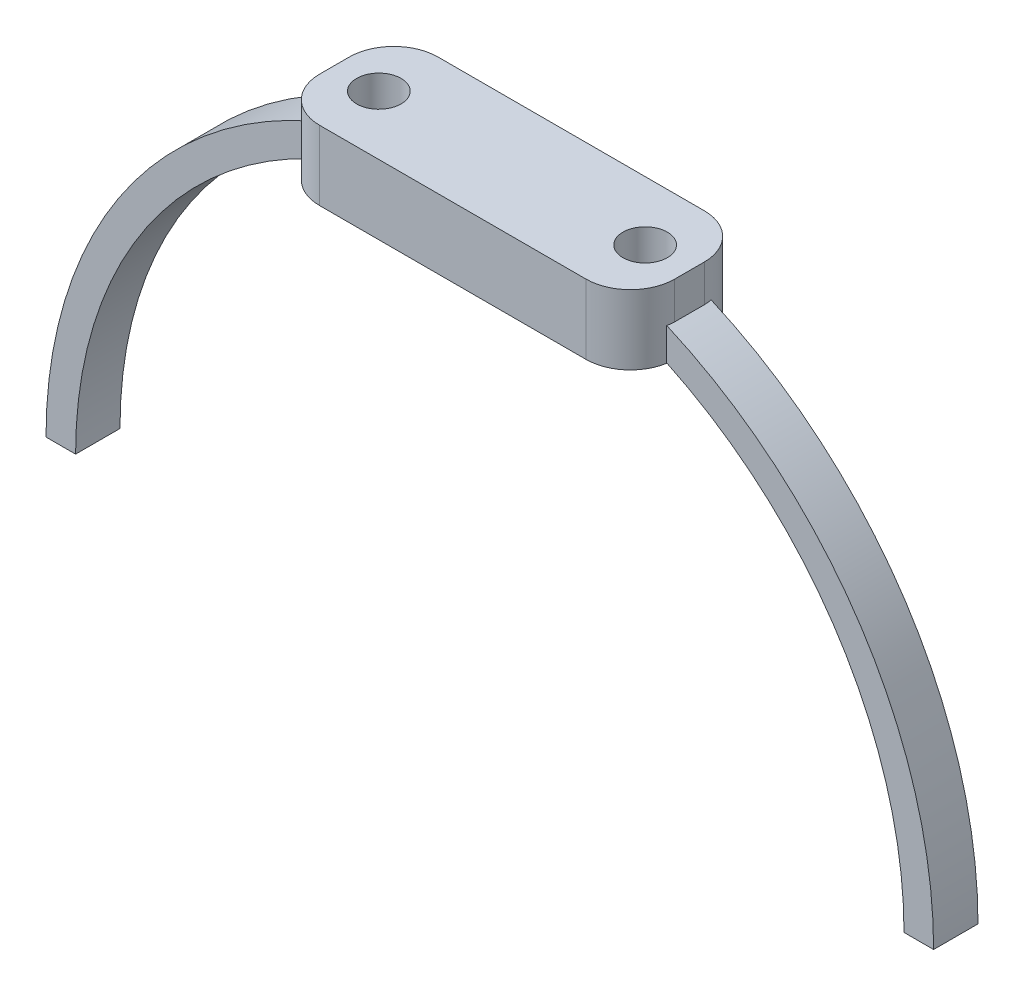
ISO-10303-21;
HEADER;
FILE_DESCRIPTION(('STEP AP214'),'2;1');
FILE_NAME('part.step','',(''),(''),'','','');
FILE_SCHEMA(('AUTOMOTIVE_DESIGN { 1 0 10303 214 1 1 1 1 }'));
ENDSEC;
DATA;
#1=APPLICATION_CONTEXT('core data for automotive mechanical design processes');
#2=APPLICATION_PROTOCOL_DEFINITION('international standard','automotive_design',2000,#1);
#3=PRODUCT_CONTEXT('',#1,'mechanical');
#4=PRODUCT('Part','Part','',(#3));
#5=PRODUCT_RELATED_PRODUCT_CATEGORY('part','',(#4));
#6=PRODUCT_DEFINITION_FORMATION('','',#4);
#7=PRODUCT_DEFINITION_CONTEXT('part definition',#1,'design');
#8=PRODUCT_DEFINITION('design','',#6,#7);
#9=PRODUCT_DEFINITION_SHAPE('','',#8);
#10=(LENGTH_UNIT() NAMED_UNIT(*) SI_UNIT(.MILLI.,.METRE.));
#11=(NAMED_UNIT(*) PLANE_ANGLE_UNIT() SI_UNIT($,.RADIAN.));
#12=(NAMED_UNIT(*) SI_UNIT($,.STERADIAN.) SOLID_ANGLE_UNIT());
#13=UNCERTAINTY_MEASURE_WITH_UNIT(LENGTH_MEASURE(1.E-05),#10,'distance_accuracy_value','');
#14=(GEOMETRIC_REPRESENTATION_CONTEXT(3) GLOBAL_UNCERTAINTY_ASSIGNED_CONTEXT((#13)) GLOBAL_UNIT_ASSIGNED_CONTEXT((#10,
#11,#12)) REPRESENTATION_CONTEXT('',''));
#15=CARTESIAN_POINT('',(0.,0.,0.));
#16=DIRECTION('',(0.,0.,1.));
#17=DIRECTION('',(1.,0.,0.));
#18=AXIS2_PLACEMENT_3D('',#15,#16,#17);
#19=CARTESIAN_POINT('',(-12.,-1.,-4.));
#20=DIRECTION('',(-1.,0.,0.));
#21=DIRECTION('',(0.,0.,1.));
#22=AXIS2_PLACEMENT_3D('',#19,#20,#21);
#23=PLANE('',#22);
#24=DIRECTION('',(0.,0.,1.));
#25=VECTOR('',#24,1.);
#26=CARTESIAN_POINT('',(-12.,-2.50454583026497,-1.5));
#27=LINE('',#26,#25);
#28=CARTESIAN_POINT('',(-12.,-2.50454583026497,-1.));
#29=VERTEX_POINT('',#28);
#30=CARTESIAN_POINT('',(-12.,-2.50454583026497,1.));
#31=VERTEX_POINT('',#30);
#32=EDGE_CURVE('E223',#29,#31,#27,.T.);
#33=ORIENTED_EDGE('',*,*,#32,.T.);
#34=DIRECTION('',(0.,1.,0.));
#35=VECTOR('',#34,1.);
#36=CARTESIAN_POINT('',(-12.,-1.,1.));
#37=LINE('',#36,#35);
#38=CARTESIAN_POINT('',(-12.,0.,1.));
#39=VERTEX_POINT('',#38);
#40=EDGE_CURVE('E257',#31,#39,#37,.T.);
#41=ORIENTED_EDGE('',*,*,#40,.T.);
#42=DIRECTION('',(0.,0.,1.));
#43=VECTOR('',#42,1.);
#44=CARTESIAN_POINT('',(-12.,0.,-4.));
#45=LINE('',#44,#43);
#46=CARTESIAN_POINT('',(-12.,0.,-1.));
#47=VERTEX_POINT('',#46);
#48=EDGE_CURVE('E237',#47,#39,#45,.T.);
#49=ORIENTED_EDGE('',*,*,#48,.F.);
#50=DIRECTION('',(0.,1.,0.));
#51=VECTOR('',#50,1.);
#52=CARTESIAN_POINT('',(-12.,-1.,-1.));
#53=LINE('',#52,#51);
#54=EDGE_CURVE('E249',#47,#29,#53,.F.);
#55=ORIENTED_EDGE('',*,*,#54,.T.);
#56=EDGE_LOOP('',(#33,#41,#49,#55));
#57=FACE_BOUND('',#56,.T.);
#58=ADVANCED_FACE('F35',(#57),#23,.T.);
#59=CARTESIAN_POINT('',(12.,-1.,-4.));
#60=DIRECTION('',(1.,0.,0.));
#61=DIRECTION('',(0.,0.,-1.));
#62=AXIS2_PLACEMENT_3D('',#59,#60,#61);
#63=PLANE('',#62);
#64=DIRECTION('',(0.,0.,-1.));
#65=VECTOR('',#64,1.);
#66=CARTESIAN_POINT('',(12.,0.,-4.));
#67=LINE('',#66,#65);
#68=CARTESIAN_POINT('',(12.,0.,1.));
#69=VERTEX_POINT('',#68);
#70=CARTESIAN_POINT('',(12.,0.,-1.));
#71=VERTEX_POINT('',#70);
#72=EDGE_CURVE('E243',#69,#71,#67,.T.);
#73=ORIENTED_EDGE('',*,*,#72,.F.);
#74=DIRECTION('',(0.,1.,0.));
#75=VECTOR('',#74,1.);
#76=CARTESIAN_POINT('',(12.,-1.,1.));
#77=LINE('',#76,#75);
#78=CARTESIAN_POINT('',(12.,-2.50454583026497,1.));
#79=VERTEX_POINT('',#78);
#80=EDGE_CURVE('E299',#69,#79,#77,.F.);
#81=ORIENTED_EDGE('',*,*,#80,.T.);
#82=DIRECTION('',(0.,0.,1.));
#83=VECTOR('',#82,1.);
#84=CARTESIAN_POINT('',(12.,-2.50454583026497,-1.5));
#85=LINE('',#84,#83);
#86=CARTESIAN_POINT('',(12.,-2.50454583026497,-1.));
#87=VERTEX_POINT('',#86);
#88=EDGE_CURVE('E217',#79,#87,#85,.F.);
#89=ORIENTED_EDGE('',*,*,#88,.T.);
#90=DIRECTION('',(0.,1.,0.));
#91=VECTOR('',#90,1.);
#92=CARTESIAN_POINT('',(12.,-1.,-1.));
#93=LINE('',#92,#91);
#94=EDGE_CURVE('E296',#87,#71,#93,.T.);
#95=ORIENTED_EDGE('',*,*,#94,.T.);
#96=EDGE_LOOP('',(#73,#81,#89,#95));
#97=FACE_BOUND('',#96,.T.);
#98=ADVANCED_FACE('F357',(#97),#63,.T.);
#99=CARTESIAN_POINT('',(12.,-1.,-4.));
#100=DIRECTION('',(0.,0.,-1.));
#101=DIRECTION('',(-1.,0.,0.));
#102=AXIS2_PLACEMENT_3D('',#99,#100,#101);
#103=PLANE('',#102);
#104=DIRECTION('',(1.,0.,0.));
#105=VECTOR('',#104,1.);
#106=CARTESIAN_POINT('',(-12.,-4.70177871865297,-4.));
#107=LINE('',#106,#105);
#108=CARTESIAN_POINT('',(-9.,-4.70177871865297,-4.));
#109=VERTEX_POINT('',#108);
#110=CARTESIAN_POINT('',(9.00000000000001,-4.70177871865297,-4.));
#111=VERTEX_POINT('',#110);
#112=EDGE_CURVE('E229',#109,#111,#107,.T.);
#113=ORIENTED_EDGE('',*,*,#112,.F.);
#114=DIRECTION('',(0.,1.,0.));
#115=VECTOR('',#114,1.);
#116=CARTESIAN_POINT('',(-9.,-1.,-4.));
#117=LINE('',#116,#115);
#118=CARTESIAN_POINT('',(-8.99999999999999,0.,-4.));
#119=VERTEX_POINT('',#118);
#120=EDGE_CURVE('E293',#109,#119,#117,.T.);
#121=ORIENTED_EDGE('',*,*,#120,.T.);
#122=DIRECTION('',(-1.,0.,0.));
#123=VECTOR('',#122,1.);
#124=CARTESIAN_POINT('',(12.,0.,-4.));
#125=LINE('',#124,#123);
#126=CARTESIAN_POINT('',(9.00000000000001,0.,-4.));
#127=VERTEX_POINT('',#126);
#128=EDGE_CURVE('E246',#127,#119,#125,.T.);
#129=ORIENTED_EDGE('',*,*,#128,.F.);
#130=DIRECTION('',(0.,1.,0.));
#131=VECTOR('',#130,1.);
#132=CARTESIAN_POINT('',(9.00000000000001,-1.,-4.));
#133=LINE('',#132,#131);
#134=EDGE_CURVE('E291',#127,#111,#133,.F.);
#135=ORIENTED_EDGE('',*,*,#134,.T.);
#136=EDGE_LOOP('',(#113,#121,#129,#135));
#137=FACE_BOUND('',#136,.T.);
#138=ADVANCED_FACE('F377',(#137),#103,.T.);
#139=CARTESIAN_POINT('',(12.,-1.,4.));
#140=DIRECTION('',(0.,0.,1.));
#141=DIRECTION('',(1.,0.,0.));
#142=AXIS2_PLACEMENT_3D('',#139,#140,#141);
#143=PLANE('',#142);
#144=DIRECTION('',(1.,0.,0.));
#145=VECTOR('',#144,1.);
#146=CARTESIAN_POINT('',(12.,0.,4.));
#147=LINE('',#146,#145);
#148=CARTESIAN_POINT('',(-9.,0.,4.));
#149=VERTEX_POINT('',#148);
#150=CARTESIAN_POINT('',(9.,0.,4.));
#151=VERTEX_POINT('',#150);
#152=EDGE_CURVE('E240',#149,#151,#147,.T.);
#153=ORIENTED_EDGE('',*,*,#152,.F.);
#154=DIRECTION('',(0.,1.,0.));
#155=VECTOR('',#154,1.);
#156=CARTESIAN_POINT('',(-9.,-1.,4.));
#157=LINE('',#156,#155);
#158=CARTESIAN_POINT('',(-9.,-4.70177871865297,4.));
#159=VERTEX_POINT('',#158);
#160=EDGE_CURVE('E271',#149,#159,#157,.F.);
#161=ORIENTED_EDGE('',*,*,#160,.T.);
#162=DIRECTION('',(1.,0.,0.));
#163=VECTOR('',#162,1.);
#164=CARTESIAN_POINT('',(-12.,-4.70177871865297,4.));
#165=LINE('',#164,#163);
#166=CARTESIAN_POINT('',(9.00000000000001,-4.70177871865297,4.));
#167=VERTEX_POINT('',#166);
#168=EDGE_CURVE('E226',#159,#167,#165,.T.);
#169=ORIENTED_EDGE('',*,*,#168,.T.);
#170=DIRECTION('',(0.,1.,0.));
#171=VECTOR('',#170,1.);
#172=CARTESIAN_POINT('',(9.,-1.,4.));
#173=LINE('',#172,#171);
#174=EDGE_CURVE('E268',#167,#151,#173,.T.);
#175=ORIENTED_EDGE('',*,*,#174,.T.);
#176=EDGE_LOOP('',(#153,#161,#169,#175));
#177=FACE_BOUND('',#176,.T.);
#178=ADVANCED_FACE('F385',(#177),#143,.T.);
#179=CARTESIAN_POINT('',(0.,0.,0.));
#180=DIRECTION('',(0.,-1.,0.));
#181=DIRECTION('',(0.,0.,-1.));
#182=AXIS2_PLACEMENT_3D('',#179,#180,#181);
#183=PLANE('',#182);
#184=CARTESIAN_POINT('',(-9.,0.,0.));
#185=DIRECTION('',(0.,1.,0.));
#186=DIRECTION('',(0.,0.,1.));
#187=AXIS2_PLACEMENT_3D('',#184,#185,#186);
#188=CIRCLE('',#187,1.5);
#189=CARTESIAN_POINT('',(-9.,0.,1.5));
#190=VERTEX_POINT('',#189);
#191=EDGE_CURVE('E253',#190,#190,#188,.T.);
#192=ORIENTED_EDGE('',*,*,#191,.F.);
#193=EDGE_LOOP('',(#192));
#194=FACE_BOUND('',#193,.T.);
#195=CARTESIAN_POINT('',(9.,0.,0.));
#196=DIRECTION('',(0.,1.,0.));
#197=DIRECTION('',(0.,0.,1.));
#198=AXIS2_PLACEMENT_3D('',#195,#196,#197);
#199=CIRCLE('',#198,1.5);
#200=CARTESIAN_POINT('',(9.,0.,1.5));
#201=VERTEX_POINT('',#200);
#202=EDGE_CURVE('E197',#201,#201,#199,.T.);
#203=ORIENTED_EDGE('',*,*,#202,.F.);
#204=EDGE_LOOP('',(#203));
#205=FACE_BOUND('',#204,.T.);
#206=ORIENTED_EDGE('',*,*,#48,.T.);
#207=CARTESIAN_POINT('',(-9.,0.,1.));
#208=DIRECTION('',(0.,-1.,0.));
#209=DIRECTION('',(0.,0.,-1.));
#210=AXIS2_PLACEMENT_3D('',#207,#208,#209);
#211=CIRCLE('',#210,3.);
#212=EDGE_CURVE('E266',#39,#149,#211,.F.);
#213=ORIENTED_EDGE('',*,*,#212,.T.);
#214=ORIENTED_EDGE('',*,*,#152,.T.);
#215=CARTESIAN_POINT('',(9.,0.,0.999999999999999));
#216=DIRECTION('',(0.,-1.,0.));
#217=DIRECTION('',(0.,0.,-1.));
#218=AXIS2_PLACEMENT_3D('',#215,#216,#217);
#219=CIRCLE('',#218,3.);
#220=EDGE_CURVE('E262',#151,#69,#219,.F.);
#221=ORIENTED_EDGE('',*,*,#220,.T.);
#222=ORIENTED_EDGE('',*,*,#72,.T.);
#223=CARTESIAN_POINT('',(9.00000000000001,0.,-1.));
#224=DIRECTION('',(0.,-1.,0.));
#225=DIRECTION('',(0.,0.,-1.));
#226=AXIS2_PLACEMENT_3D('',#223,#224,#225);
#227=CIRCLE('',#226,3.);
#228=EDGE_CURVE('E260',#71,#127,#227,.F.);
#229=ORIENTED_EDGE('',*,*,#228,.T.);
#230=ORIENTED_EDGE('',*,*,#128,.T.);
#231=CARTESIAN_POINT('',(-9.,0.,-1.));
#232=DIRECTION('',(0.,-1.,0.));
#233=DIRECTION('',(0.,0.,-1.));
#234=AXIS2_PLACEMENT_3D('',#231,#232,#233);
#235=CIRCLE('',#234,3.);
#236=EDGE_CURVE('E264',#119,#47,#235,.F.);
#237=ORIENTED_EDGE('',*,*,#236,.T.);
#238=EDGE_LOOP('',(#206,#213,#214,#221,#222,#229,#230,#237));
#239=FACE_BOUND('',#238,.T.);
#240=ADVANCED_FACE('F380',(#194,#205,#239),#183,.F.);
#241=CARTESIAN_POINT('',(-12.,-4.70177871865297,-28.4562205403692));
#242=DIRECTION('',(0.,-1.,0.));
#243=DIRECTION('',(0.,0.,-1.));
#244=AXIS2_PLACEMENT_3D('',#241,#242,#243);
#245=PLANE('',#244);
#246=CARTESIAN_POINT('',(-9.,-4.70177871865297,0.));
#247=DIRECTION('',(0.,-1.,0.));
#248=DIRECTION('',(0.,0.,-1.));
#249=AXIS2_PLACEMENT_3D('',#246,#247,#248);
#250=CIRCLE('',#249,1.5);
#251=CARTESIAN_POINT('',(-9.,-4.70177871865297,1.5));
#252=VERTEX_POINT('',#251);
#253=EDGE_CURVE('E195',#252,#252,#250,.T.);
#254=ORIENTED_EDGE('',*,*,#253,.F.);
#255=EDGE_LOOP('',(#254));
#256=FACE_BOUND('',#255,.T.);
#257=CARTESIAN_POINT('',(9.,-4.70177871865297,0.));
#258=DIRECTION('',(0.,-1.,0.));
#259=DIRECTION('',(0.,0.,-1.));
#260=AXIS2_PLACEMENT_3D('',#257,#258,#259);
#261=CIRCLE('',#260,1.5);
#262=CARTESIAN_POINT('',(9.,-4.70177871865297,1.5));
#263=VERTEX_POINT('',#262);
#264=EDGE_CURVE('E250',#263,#263,#261,.T.);
#265=ORIENTED_EDGE('',*,*,#264,.F.);
#266=EDGE_LOOP('',(#265));
#267=FACE_BOUND('',#266,.T.);
#268=CARTESIAN_POINT('',(-9.,-4.70177871865297,1.));
#269=DIRECTION('',(0.,-1.,0.));
#270=DIRECTION('',(0.,0.,-1.));
#271=AXIS2_PLACEMENT_3D('',#268,#269,#270);
#272=CIRCLE('',#271,3.);
#273=CARTESIAN_POINT('',(-11.9580398915498,-4.70177871865297,1.5));
#274=VERTEX_POINT('',#273);
#275=EDGE_CURVE('E286',#159,#274,#272,.T.);
#276=ORIENTED_EDGE('',*,*,#275,.T.);
#277=DIRECTION('',(-1.,0.,0.));
#278=VECTOR('',#277,1.);
#279=CARTESIAN_POINT('',(-12.,-4.70177871865297,1.5));
#280=LINE('',#279,#278);
#281=CARTESIAN_POINT('',(-12.,-4.70177871865297,1.5));
#282=VERTEX_POINT('',#281);
#283=EDGE_CURVE('E289',#274,#282,#280,.T.);
#284=ORIENTED_EDGE('',*,*,#283,.T.);
#285=DIRECTION('',(0.,0.,1.));
#286=VECTOR('',#285,1.);
#287=CARTESIAN_POINT('',(-12.,-4.70177871865297,-28.4562205403692));
#288=LINE('',#287,#286);
#289=CARTESIAN_POINT('',(-12.,-4.70177871865297,-1.5));
#290=VERTEX_POINT('',#289);
#291=EDGE_CURVE('E234',#290,#282,#288,.T.);
#292=ORIENTED_EDGE('',*,*,#291,.F.);
#293=DIRECTION('',(1.,0.,0.));
#294=VECTOR('',#293,1.);
#295=CARTESIAN_POINT('',(0.,-4.70177871865297,-1.5));
#296=LINE('',#295,#294);
#297=CARTESIAN_POINT('',(-11.9580398915498,-4.70177871865297,-1.5));
#298=VERTEX_POINT('',#297);
#299=EDGE_CURVE('E283',#290,#298,#296,.T.);
#300=ORIENTED_EDGE('',*,*,#299,.T.);
#301=CARTESIAN_POINT('',(-9.,-4.70177871865297,-1.));
#302=DIRECTION('',(0.,-1.,0.));
#303=DIRECTION('',(0.,0.,-1.));
#304=AXIS2_PLACEMENT_3D('',#301,#302,#303);
#305=CIRCLE('',#304,3.);
#306=EDGE_CURVE('E281',#298,#109,#305,.T.);
#307=ORIENTED_EDGE('',*,*,#306,.T.);
#308=ORIENTED_EDGE('',*,*,#112,.T.);
#309=CARTESIAN_POINT('',(9.00000000000001,-4.70177871865297,-1.));
#310=DIRECTION('',(0.,-1.,0.));
#311=DIRECTION('',(0.,0.,-1.));
#312=AXIS2_PLACEMENT_3D('',#309,#310,#311);
#313=CIRCLE('',#312,3.);
#314=CARTESIAN_POINT('',(11.9580398915498,-4.70177871865297,-1.5));
#315=VERTEX_POINT('',#314);
#316=EDGE_CURVE('E273',#111,#315,#313,.T.);
#317=ORIENTED_EDGE('',*,*,#316,.T.);
#318=DIRECTION('',(1.,0.,0.));
#319=VECTOR('',#318,1.);
#320=CARTESIAN_POINT('',(0.,-4.70177871865297,-1.5));
#321=LINE('',#320,#319);
#322=CARTESIAN_POINT('',(12.,-4.70177871865297,-1.5));
#323=VERTEX_POINT('',#322);
#324=EDGE_CURVE('E276',#315,#323,#321,.T.);
#325=ORIENTED_EDGE('',*,*,#324,.T.);
#326=DIRECTION('',(0.,0.,1.));
#327=VECTOR('',#326,1.);
#328=CARTESIAN_POINT('',(12.,-4.70177871865297,-28.4562205403692));
#329=LINE('',#328,#327);
#330=CARTESIAN_POINT('',(12.,-4.70177871865297,1.5));
#331=VERTEX_POINT('',#330);
#332=EDGE_CURVE('E232',#323,#331,#329,.T.);
#333=ORIENTED_EDGE('',*,*,#332,.T.);
#334=DIRECTION('',(-1.,0.,0.));
#335=VECTOR('',#334,1.);
#336=CARTESIAN_POINT('',(-12.,-4.70177871865297,1.5));
#337=LINE('',#336,#335);
#338=CARTESIAN_POINT('',(11.9580398915498,-4.70177871865297,1.5));
#339=VERTEX_POINT('',#338);
#340=EDGE_CURVE('E63',#331,#339,#337,.T.);
#341=ORIENTED_EDGE('',*,*,#340,.T.);
#342=CARTESIAN_POINT('',(9.,-4.70177871865297,0.999999999999999));
#343=DIRECTION('',(0.,-1.,0.));
#344=DIRECTION('',(0.,0.,-1.));
#345=AXIS2_PLACEMENT_3D('',#342,#343,#344);
#346=CIRCLE('',#345,3.);
#347=EDGE_CURVE('E278',#339,#167,#346,.T.);
#348=ORIENTED_EDGE('',*,*,#347,.T.);
#349=ORIENTED_EDGE('',*,*,#168,.F.);
#350=EDGE_LOOP('',(#276,#284,#292,#300,#307,#308,#317,#325,#333,#341,#348,#349));
#351=FACE_BOUND('',#350,.T.);
#352=ADVANCED_FACE('F372',(#256,#267,#351),#245,.T.);
#353=CARTESIAN_POINT('',(0.,-30.,-1.5));
#354=DIRECTION('',(0.,-1.,0.));
#355=DIRECTION('',(1.,0.,0.));
#356=AXIS2_PLACEMENT_3D('',#353,#354,#355);
#357=PLANE('',#356);
#358=DIRECTION('',(0.,0.,1.));
#359=VECTOR('',#358,1.);
#360=CARTESIAN_POINT('',(-28.,-30.,-1.5));
#361=LINE('',#360,#359);
#362=CARTESIAN_POINT('',(-28.,-30.,-1.5));
#363=VERTEX_POINT('',#362);
#364=CARTESIAN_POINT('',(-28.,-30.,1.5));
#365=VERTEX_POINT('',#364);
#366=EDGE_CURVE('E177',#363,#365,#361,.T.);
#367=ORIENTED_EDGE('',*,*,#366,.T.);
#368=DIRECTION('',(1.,0.,0.));
#369=VECTOR('',#368,1.);
#370=CARTESIAN_POINT('',(0.,-30.,1.5));
#371=LINE('',#370,#369);
#372=CARTESIAN_POINT('',(-30.,-30.,1.5));
#373=VERTEX_POINT('',#372);
#374=EDGE_CURVE('E182',#373,#365,#371,.T.);
#375=ORIENTED_EDGE('',*,*,#374,.F.);
#376=DIRECTION('',(0.,0.,1.));
#377=VECTOR('',#376,1.);
#378=CARTESIAN_POINT('',(-30.,-30.,-1.5));
#379=LINE('',#378,#377);
#380=CARTESIAN_POINT('',(-30.,-30.,-1.5));
#381=VERTEX_POINT('',#380);
#382=EDGE_CURVE('E165',#381,#373,#379,.T.);
#383=ORIENTED_EDGE('',*,*,#382,.F.);
#384=DIRECTION('',(1.,0.,0.));
#385=VECTOR('',#384,1.);
#386=CARTESIAN_POINT('',(0.,-30.,-1.5));
#387=LINE('',#386,#385);
#388=EDGE_CURVE('E207',#381,#363,#387,.T.);
#389=ORIENTED_EDGE('',*,*,#388,.T.);
#390=EDGE_LOOP('',(#367,#375,#383,#389));
#391=FACE_BOUND('',#390,.T.);
#392=ADVANCED_FACE('F183',(#391),#357,.T.);
#393=CARTESIAN_POINT('',(0.,-30.,-1.5));
#394=DIRECTION('',(0.,0.,1.));
#395=DIRECTION('',(1.,0.,0.));
#396=AXIS2_PLACEMENT_3D('',#393,#394,#395);
#397=CYLINDRICAL_SURFACE('',#396,28.);
#398=ORIENTED_EDGE('',*,*,#291,.T.);
#399=CARTESIAN_POINT('',(0.,-30.,1.5));
#400=DIRECTION('',(0.,0.,1.));
#401=DIRECTION('',(1.,0.,0.));
#402=AXIS2_PLACEMENT_3D('',#399,#400,#401);
#403=CIRCLE('',#402,28.);
#404=EDGE_CURVE('E187',#282,#365,#403,.T.);
#405=ORIENTED_EDGE('',*,*,#404,.T.);
#406=ORIENTED_EDGE('',*,*,#366,.F.);
#407=CARTESIAN_POINT('',(0.,-30.,-1.5));
#408=DIRECTION('',(0.,0.,1.));
#409=DIRECTION('',(1.,0.,0.));
#410=AXIS2_PLACEMENT_3D('',#407,#408,#409);
#411=CIRCLE('',#410,28.);
#412=EDGE_CURVE('E209',#290,#363,#411,.T.);
#413=ORIENTED_EDGE('',*,*,#412,.F.);
#414=EDGE_LOOP('',(#398,#405,#406,#413));
#415=FACE_BOUND('',#414,.T.);
#416=ADVANCED_FACE('F392',(#415),#397,.F.);
#417=CARTESIAN_POINT('',(0.,0.,1.5));
#418=DIRECTION('',(0.,0.,1.));
#419=DIRECTION('',(1.,0.,0.));
#420=AXIS2_PLACEMENT_3D('',#417,#418,#419);
#421=PLANE('',#420);
#422=ORIENTED_EDGE('',*,*,#404,.F.);
#423=ORIENTED_EDGE('',*,*,#283,.F.);
#424=DIRECTION('',(0.,1.,0.));
#425=VECTOR('',#424,1.);
#426=CARTESIAN_POINT('',(-11.9580398915498,-4.70177871865297,1.5));
#427=LINE('',#426,#425);
#428=CARTESIAN_POINT('',(-11.9580398915498,-2.48627102786497,1.5));
#429=VERTEX_POINT('',#428);
#430=EDGE_CURVE('E191',#274,#429,#427,.T.);
#431=ORIENTED_EDGE('',*,*,#430,.T.);
#432=CARTESIAN_POINT('',(0.,-30.,1.5));
#433=DIRECTION('',(0.,0.,1.));
#434=DIRECTION('',(1.,0.,0.));
#435=AXIS2_PLACEMENT_3D('',#432,#433,#434);
#436=CIRCLE('',#435,30.);
#437=EDGE_CURVE('E170',#373,#429,#436,.F.);
#438=ORIENTED_EDGE('',*,*,#437,.F.);
#439=ORIENTED_EDGE('',*,*,#374,.T.);
#440=EDGE_LOOP('',(#422,#423,#431,#438,#439));
#441=FACE_BOUND('',#440,.T.);
#442=ADVANCED_FACE('F189',(#441),#421,.T.);
#443=CARTESIAN_POINT('',(0.,0.,-1.5));
#444=DIRECTION('',(0.,0.,1.));
#445=DIRECTION('',(1.,0.,0.));
#446=AXIS2_PLACEMENT_3D('',#443,#444,#445);
#447=PLANE('',#446);
#448=CARTESIAN_POINT('',(0.,-30.,-1.5));
#449=DIRECTION('',(0.,0.,1.));
#450=DIRECTION('',(1.,0.,0.));
#451=AXIS2_PLACEMENT_3D('',#448,#449,#450);
#452=CIRCLE('',#451,30.);
#453=CARTESIAN_POINT('',(-11.9580398915498,-2.48627102786497,-1.5));
#454=VERTEX_POINT('',#453);
#455=EDGE_CURVE('E173',#381,#454,#452,.F.);
#456=ORIENTED_EDGE('',*,*,#455,.T.);
#457=DIRECTION('',(0.,1.,0.));
#458=VECTOR('',#457,1.);
#459=CARTESIAN_POINT('',(-11.9580398915498,-2.48627102786497,-1.5));
#460=LINE('',#459,#458);
#461=EDGE_CURVE('E344',#454,#298,#460,.F.);
#462=ORIENTED_EDGE('',*,*,#461,.T.);
#463=ORIENTED_EDGE('',*,*,#299,.F.);
#464=ORIENTED_EDGE('',*,*,#412,.T.);
#465=ORIENTED_EDGE('',*,*,#388,.F.);
#466=EDGE_LOOP('',(#456,#462,#463,#464,#465));
#467=FACE_BOUND('',#466,.T.);
#468=ADVANCED_FACE('F394',(#467),#447,.F.);
#469=CARTESIAN_POINT('',(0.,-30.,-1.5));
#470=DIRECTION('',(0.,0.,1.));
#471=DIRECTION('',(1.,0.,0.));
#472=AXIS2_PLACEMENT_3D('',#469,#470,#471);
#473=CYLINDRICAL_SURFACE('',#472,30.);
#474=ORIENTED_EDGE('',*,*,#32,.F.);
#475=CARTESIAN_POINT('',(-12.,-2.50454583026497,-1.));
#476=CARTESIAN_POINT('',(-11.9999784934391,-2.5045316933195,-1.08402921821506));
#477=CARTESIAN_POINT('',(-11.9964710644505,-2.50300172464501,-1.16771049401314));
#478=CARTESIAN_POINT('',(-11.9824843616257,-2.49691012384151,-1.334377160679));
#479=CARTESIAN_POINT('',(-11.9720050877976,-2.492348491716,-1.41736255154759));
#480=CARTESIAN_POINT('',(-11.9580398915498,-2.48627102786496,-1.5));
#481=B_SPLINE_CURVE_WITH_KNOTS('',3,(#475,#476,#477,#478,#479,#480),.UNSPECIFIED.,.F.,.F.,(4,2,
4),(0.,0.251306165927237,0.502612331563934),.UNSPECIFIED.);
#482=EDGE_CURVE('E309',#29,#454,#481,.T.);
#483=ORIENTED_EDGE('',*,*,#482,.T.);
#484=ORIENTED_EDGE('',*,*,#455,.F.);
#485=ORIENTED_EDGE('',*,*,#382,.T.);
#486=ORIENTED_EDGE('',*,*,#437,.T.);
#487=CARTESIAN_POINT('',(-11.9580398915498,-2.48627102786497,1.5));
#488=CARTESIAN_POINT('',(-11.9720050877976,-2.49234849171599,1.41736255154759));
#489=CARTESIAN_POINT('',(-11.9824843616257,-2.4969101238415,1.334377160679));
#490=CARTESIAN_POINT('',(-11.9964710644505,-2.50300172464501,1.16771049401314));
#491=CARTESIAN_POINT('',(-11.9999784934391,-2.5045316933195,1.08402921821506));
#492=CARTESIAN_POINT('',(-12.,-2.50454583026497,1.));
#493=B_SPLINE_CURVE_WITH_KNOTS('',3,(#487,#488,#489,#490,#491,#492),.UNSPECIFIED.,.F.,.F.,(4,2,
4),(0.,0.251306165636698,0.502612331563934),.UNSPECIFIED.);
#494=EDGE_CURVE('E302',#429,#31,#493,.T.);
#495=ORIENTED_EDGE('',*,*,#494,.T.);
#496=EDGE_LOOP('',(#474,#483,#484,#485,#486,#495));
#497=FACE_BOUND('',#496,.T.);
#498=ADVANCED_FACE('F168',(#497),#473,.T.);
#499=ORIENTED_EDGE('',*,*,#332,.F.);
#500=CARTESIAN_POINT('',(28.,-30.,-1.5));
#501=VERTEX_POINT('',#500);
#502=EDGE_CURVE('E210',#501,#323,#411,.T.);
#503=ORIENTED_EDGE('',*,*,#502,.F.);
#504=DIRECTION('',(0.,0.,1.));
#505=VECTOR('',#504,1.);
#506=CARTESIAN_POINT('',(28.,-30.,-1.5));
#507=LINE('',#506,#505);
#508=CARTESIAN_POINT('',(28.,-30.,1.5));
#509=VERTEX_POINT('',#508);
#510=EDGE_CURVE('E218',#501,#509,#507,.T.);
#511=ORIENTED_EDGE('',*,*,#510,.T.);
#512=EDGE_CURVE('E200',#509,#331,#403,.T.);
#513=ORIENTED_EDGE('',*,*,#512,.T.);
#514=EDGE_LOOP('',(#499,#503,#511,#513));
#515=FACE_BOUND('',#514,.T.);
#516=ADVANCED_FACE('F369',(#515),#397,.F.);
#517=ORIENTED_EDGE('',*,*,#88,.F.);
#518=CARTESIAN_POINT('',(12.,-2.50454583026497,1.));
#519=CARTESIAN_POINT('',(11.9999784934391,-2.5045316933195,1.08402921821506));
#520=CARTESIAN_POINT('',(11.9964710644505,-2.50300172464501,1.16771049401314));
#521=CARTESIAN_POINT('',(11.9824843616257,-2.4969101238415,1.334377160679));
#522=CARTESIAN_POINT('',(11.9720050877976,-2.49234849171599,1.41736255154759));
#523=CARTESIAN_POINT('',(11.9580398915498,-2.48627102786496,1.5));
#524=B_SPLINE_CURVE_WITH_KNOTS('',3,(#518,#519,#520,#521,#522,#523),.UNSPECIFIED.,.F.,.F.,(4,2,
4),(0.,0.251306165927237,0.502612331563935),.UNSPECIFIED.);
#525=CARTESIAN_POINT('',(11.9580398915498,-2.48627102786496,1.5));
#526=VERTEX_POINT('',#525);
#527=EDGE_CURVE('E336',#79,#526,#524,.T.);
#528=ORIENTED_EDGE('',*,*,#527,.T.);
#529=CARTESIAN_POINT('',(30.,-30.,1.5));
#530=VERTEX_POINT('',#529);
#531=EDGE_CURVE('E193',#526,#530,#436,.F.);
#532=ORIENTED_EDGE('',*,*,#531,.T.);
#533=DIRECTION('',(0.,0.,1.));
#534=VECTOR('',#533,1.);
#535=CARTESIAN_POINT('',(30.,-30.,-1.5));
#536=LINE('',#535,#534);
#537=CARTESIAN_POINT('',(30.,-30.,-1.5));
#538=VERTEX_POINT('',#537);
#539=EDGE_CURVE('E214',#538,#530,#536,.T.);
#540=ORIENTED_EDGE('',*,*,#539,.F.);
#541=CARTESIAN_POINT('',(11.9580398915498,-2.48627102786496,-1.5));
#542=VERTEX_POINT('',#541);
#543=EDGE_CURVE('E55',#542,#538,#452,.F.);
#544=ORIENTED_EDGE('',*,*,#543,.F.);
#545=CARTESIAN_POINT('',(11.9580398915498,-2.48627102786496,-1.5));
#546=CARTESIAN_POINT('',(11.9720050877976,-2.49234849171599,-1.41736255154759));
#547=CARTESIAN_POINT('',(11.9824843616257,-2.4969101238415,-1.334377160679));
#548=CARTESIAN_POINT('',(11.9964710644505,-2.50300172464501,-1.16771049401314));
#549=CARTESIAN_POINT('',(11.9999784934391,-2.5045316933195,-1.08402921821506));
#550=CARTESIAN_POINT('',(12.,-2.50454583026497,-1.));
#551=B_SPLINE_CURVE_WITH_KNOTS('',3,(#545,#546,#547,#548,#549,#550),.UNSPECIFIED.,.F.,.F.,(4,2,
4),(0.,0.251306165636697,0.502612331563933),.UNSPECIFIED.);
#552=EDGE_CURVE('E11',#542,#87,#551,.T.);
#553=ORIENTED_EDGE('',*,*,#552,.T.);
#554=EDGE_LOOP('',(#517,#528,#532,#540,#544,#553));
#555=FACE_BOUND('',#554,.T.);
#556=ADVANCED_FACE('F316',(#555),#473,.T.);
#557=CARTESIAN_POINT('',(0.,-30.,-1.5));
#558=DIRECTION('',(0.,1.,0.));
#559=DIRECTION('',(-1.,0.,0.));
#560=AXIS2_PLACEMENT_3D('',#557,#558,#559);
#561=PLANE('',#560);
#562=ORIENTED_EDGE('',*,*,#539,.T.);
#563=DIRECTION('',(-1.,0.,0.));
#564=VECTOR('',#563,1.);
#565=CARTESIAN_POINT('',(0.,-30.,1.5));
#566=LINE('',#565,#564);
#567=EDGE_CURVE('E203',#530,#509,#566,.T.);
#568=ORIENTED_EDGE('',*,*,#567,.T.);
#569=ORIENTED_EDGE('',*,*,#510,.F.);
#570=DIRECTION('',(-1.,0.,0.));
#571=VECTOR('',#570,1.);
#572=CARTESIAN_POINT('',(0.,-30.,-1.5));
#573=LINE('',#572,#571);
#574=EDGE_CURVE('E178',#538,#501,#573,.T.);
#575=ORIENTED_EDGE('',*,*,#574,.F.);
#576=EDGE_LOOP('',(#562,#568,#569,#575));
#577=FACE_BOUND('',#576,.T.);
#578=ADVANCED_FACE('F364',(#577),#561,.F.);
#579=ORIENTED_EDGE('',*,*,#502,.T.);
#580=ORIENTED_EDGE('',*,*,#324,.F.);
#581=DIRECTION('',(0.,1.,0.));
#582=VECTOR('',#581,1.);
#583=CARTESIAN_POINT('',(11.9580398915498,-4.70177871865297,-1.5));
#584=LINE('',#583,#582);
#585=EDGE_CURVE('E49',#315,#542,#584,.T.);
#586=ORIENTED_EDGE('',*,*,#585,.T.);
#587=ORIENTED_EDGE('',*,*,#543,.T.);
#588=ORIENTED_EDGE('',*,*,#574,.T.);
#589=EDGE_LOOP('',(#579,#580,#586,#587,#588));
#590=FACE_BOUND('',#589,.T.);
#591=ADVANCED_FACE('F348',(#590),#447,.F.);
#592=ORIENTED_EDGE('',*,*,#531,.F.);
#593=DIRECTION('',(0.,1.,0.));
#594=VECTOR('',#593,1.);
#595=CARTESIAN_POINT('',(11.9580398915498,-2.48627102786496,1.5));
#596=LINE('',#595,#594);
#597=EDGE_CURVE('E343',#526,#339,#596,.F.);
#598=ORIENTED_EDGE('',*,*,#597,.T.);
#599=ORIENTED_EDGE('',*,*,#340,.F.);
#600=ORIENTED_EDGE('',*,*,#512,.F.);
#601=ORIENTED_EDGE('',*,*,#567,.F.);
#602=EDGE_LOOP('',(#592,#598,#599,#600,#601));
#603=FACE_BOUND('',#602,.T.);
#604=ADVANCED_FACE('F366',(#603),#421,.T.);
#605=CARTESIAN_POINT('',(9.,-30.,0.));
#606=DIRECTION('',(0.,1.,0.));
#607=DIRECTION('',(0.,0.,1.));
#608=AXIS2_PLACEMENT_3D('',#605,#606,#607);
#609=CYLINDRICAL_SURFACE('',#608,1.5);
#610=CARTESIAN_POINT('',(9.,-4.70177871865297,1.5));
#611=CARTESIAN_POINT('',(9.,-4.65280185700034,1.5));
#612=CARTESIAN_POINT('',(9.,-4.6038249953477,1.5));
#613=CARTESIAN_POINT('',(9.,-4.50587127204243,1.5));
#614=CARTESIAN_POINT('',(9.,-4.4568944103898,1.5));
#615=CARTESIAN_POINT('',(9.,-4.35894068708453,1.5));
#616=CARTESIAN_POINT('',(9.,-4.30996382543189,1.5));
#617=CARTESIAN_POINT('',(9.,-4.21201010212662,1.5));
#618=CARTESIAN_POINT('',(9.,-4.16303324047399,1.5));
#619=CARTESIAN_POINT('',(9.,-4.06507951716872,1.5));
#620=CARTESIAN_POINT('',(9.,-4.01610265551608,1.5));
#621=CARTESIAN_POINT('',(9.,-3.91814893221081,1.5));
#622=CARTESIAN_POINT('',(9.,-3.86917207055818,1.5));
#623=CARTESIAN_POINT('',(9.,-3.77121834725291,1.5));
#624=CARTESIAN_POINT('',(9.,-3.72224148560027,1.5));
#625=CARTESIAN_POINT('',(9.,-3.624287762295,1.5));
#626=CARTESIAN_POINT('',(9.,-3.57531090064237,1.5));
#627=CARTESIAN_POINT('',(9.,-3.4773571773371,1.5));
#628=CARTESIAN_POINT('',(9.,-3.42838031568446,1.5));
#629=CARTESIAN_POINT('',(9.,-3.33042659237919,1.5));
#630=CARTESIAN_POINT('',(9.,-3.28144973072656,1.5));
#631=CARTESIAN_POINT('',(9.,-3.18349600742129,1.5));
#632=CARTESIAN_POINT('',(9.,-3.13451914576865,1.5));
#633=CARTESIAN_POINT('',(9.,-3.03656542246338,1.5));
#634=CARTESIAN_POINT('',(9.,-2.98758856081074,1.5));
#635=CARTESIAN_POINT('',(9.,-2.88963483750547,1.5));
#636=CARTESIAN_POINT('',(9.,-2.84065797585284,1.5));
#637=CARTESIAN_POINT('',(9.,-2.74270425254757,1.5));
#638=CARTESIAN_POINT('',(9.,-2.69372739089493,1.5));
#639=CARTESIAN_POINT('',(9.,-2.59577366758966,1.5));
#640=CARTESIAN_POINT('',(9.,-2.54679680593703,1.5));
#641=CARTESIAN_POINT('',(9.,-2.44884308263176,1.5));
#642=CARTESIAN_POINT('',(9.,-2.39986622097912,1.5));
#643=CARTESIAN_POINT('',(9.,-2.30191249767385,1.5));
#644=CARTESIAN_POINT('',(9.,-2.25293563602122,1.5));
#645=CARTESIAN_POINT('',(9.,-2.15498191271595,1.5));
#646=CARTESIAN_POINT('',(9.,-2.10600505106331,1.5));
#647=CARTESIAN_POINT('',(9.,-2.00805132775804,1.5));
#648=CARTESIAN_POINT('',(9.,-1.95907446610541,1.5));
#649=CARTESIAN_POINT('',(9.,-1.86112074280014,1.5));
#650=CARTESIAN_POINT('',(9.,-1.8121438811475,1.5));
#651=CARTESIAN_POINT('',(9.,-1.71419015784223,1.5));
#652=CARTESIAN_POINT('',(9.,-1.66521329618959,1.5));
#653=CARTESIAN_POINT('',(9.,-1.56725957288432,1.5));
#654=CARTESIAN_POINT('',(9.,-1.51828271123169,1.5));
#655=CARTESIAN_POINT('',(9.,-1.42032898792642,1.5));
#656=CARTESIAN_POINT('',(9.,-1.37135212627378,1.5));
#657=CARTESIAN_POINT('',(9.,-1.27339840296851,1.5));
#658=CARTESIAN_POINT('',(9.,-1.22442154131588,1.5));
#659=CARTESIAN_POINT('',(9.,-1.12646781801061,1.5));
#660=CARTESIAN_POINT('',(9.,-1.07749095635797,1.5));
#661=CARTESIAN_POINT('',(9.,-0.979537233052704,1.5));
#662=CARTESIAN_POINT('',(9.,-0.930560371400069,1.5));
#663=CARTESIAN_POINT('',(9.,-0.832606648094797,1.5));
#664=CARTESIAN_POINT('',(9.,-0.783629786442161,1.5));
#665=CARTESIAN_POINT('',(9.,-0.68567606313689,1.5));
#666=CARTESIAN_POINT('',(9.,-0.636699201484255,1.5));
#667=CARTESIAN_POINT('',(9.,-0.538745478178985,1.5));
#668=CARTESIAN_POINT('',(9.,-0.48976861652635,1.5));
#669=CARTESIAN_POINT('',(9.,-0.39181489322108,1.5));
#670=CARTESIAN_POINT('',(9.,-0.342838031568445,1.5));
#671=CARTESIAN_POINT('',(9.,-0.244884308263175,1.5));
#672=CARTESIAN_POINT('',(9.,-0.19590744661054,1.5));
#673=CARTESIAN_POINT('',(9.,-0.09795372330527,1.5));
#674=CARTESIAN_POINT('',(9.,-0.048976861652635,1.5));
#675=CARTESIAN_POINT('',(9.,0.,1.5));
#676=B_SPLINE_CURVE_WITH_KNOTS('',3,(#610,#611,#612,#613,#614,#615,#616,#617,#618,#619,#620,
#621,#622,#623,#624,#625,#626,#627,#628,#629,#630,#631,#632,#633,#634,#635,#636,#637,#638,#639,
#640,#641,#642,#643,#644,#645,#646,#647,#648,#649,#650,#651,#652,#653,#654,#655,#656,#657,#658,
#659,#660,#661,#662,#663,#664,#665,#666,#667,#668,#669,#670,#671,#672,#673,#674,#675),
.UNSPECIFIED.,.F.,.F.,(4,2,2,2,2,2,2,2,2,2,2,2,2,2,2,2,2,2,2,2,2,2,2,2,2,2,2,2,2,2,2,2,4),(0.,
0.146930584957905,0.29386116991581,0.440791754873715,0.58772233983162,0.734652924789528,
0.881583509747433,1.02851409470534,1.17544467966324,1.32237526462115,1.46930584957905,
1.61623643453696,1.76316701949487,1.91009760445277,2.05702818941068,2.20395877436858,
2.35088935932649,2.49781994428439,2.6447505292423,2.7916811142002,2.93861169915811,
3.08554228411602,3.23247286907392,3.37940345403183,3.52633403898973,3.67326462394764,
3.82019520890554,3.96712579386345,4.11405637882135,4.26098696377926,4.40791754873716,
4.55484813369507,4.70177871865297),.UNSPECIFIED.);
#677=EDGE_CURVE('BSEAM427',#263,#201,#676,.T.);
#678=ORIENTED_EDGE('',*,*,#264,.T.);
#679=ORIENTED_EDGE('',*,*,#202,.T.);
#680=ORIENTED_EDGE('',*,*,#677,.T.);
#681=ORIENTED_EDGE('',*,*,#677,.F.);
#682=EDGE_LOOP('',(#678,#680,#679,#681));
#683=FACE_BOUND('',#682,.T.);
#684=ADVANCED_FACE('F427',(#683),#609,.F.);
#685=CARTESIAN_POINT('',(-9.,-30.,0.));
#686=DIRECTION('',(0.,1.,0.));
#687=DIRECTION('',(0.,0.,1.));
#688=AXIS2_PLACEMENT_3D('',#685,#686,#687);
#689=CYLINDRICAL_SURFACE('',#688,1.5);
#690=CARTESIAN_POINT('',(-9.,-4.70177871865297,1.5));
#691=CARTESIAN_POINT('',(-9.,-4.65280185700034,1.5));
#692=CARTESIAN_POINT('',(-9.,-4.6038249953477,1.5));
#693=CARTESIAN_POINT('',(-9.,-4.50587127204243,1.5));
#694=CARTESIAN_POINT('',(-9.,-4.4568944103898,1.5));
#695=CARTESIAN_POINT('',(-9.,-4.35894068708453,1.5));
#696=CARTESIAN_POINT('',(-9.,-4.30996382543189,1.5));
#697=CARTESIAN_POINT('',(-9.,-4.21201010212662,1.5));
#698=CARTESIAN_POINT('',(-9.,-4.16303324047399,1.5));
#699=CARTESIAN_POINT('',(-9.,-4.06507951716872,1.5));
#700=CARTESIAN_POINT('',(-9.,-4.01610265551608,1.5));
#701=CARTESIAN_POINT('',(-9.,-3.91814893221081,1.5));
#702=CARTESIAN_POINT('',(-9.,-3.86917207055818,1.5));
#703=CARTESIAN_POINT('',(-9.,-3.77121834725291,1.5));
#704=CARTESIAN_POINT('',(-9.,-3.72224148560027,1.5));
#705=CARTESIAN_POINT('',(-9.,-3.624287762295,1.5));
#706=CARTESIAN_POINT('',(-9.,-3.57531090064237,1.5));
#707=CARTESIAN_POINT('',(-9.,-3.4773571773371,1.5));
#708=CARTESIAN_POINT('',(-9.,-3.42838031568446,1.5));
#709=CARTESIAN_POINT('',(-9.,-3.33042659237919,1.5));
#710=CARTESIAN_POINT('',(-9.,-3.28144973072656,1.5));
#711=CARTESIAN_POINT('',(-9.,-3.18349600742129,1.5));
#712=CARTESIAN_POINT('',(-9.,-3.13451914576865,1.5));
#713=CARTESIAN_POINT('',(-9.,-3.03656542246338,1.5));
#714=CARTESIAN_POINT('',(-9.,-2.98758856081074,1.5));
#715=CARTESIAN_POINT('',(-9.,-2.88963483750547,1.5));
#716=CARTESIAN_POINT('',(-9.,-2.84065797585284,1.5));
#717=CARTESIAN_POINT('',(-9.,-2.74270425254757,1.5));
#718=CARTESIAN_POINT('',(-9.,-2.69372739089493,1.5));
#719=CARTESIAN_POINT('',(-9.,-2.59577366758966,1.5));
#720=CARTESIAN_POINT('',(-9.,-2.54679680593703,1.5));
#721=CARTESIAN_POINT('',(-9.,-2.44884308263176,1.5));
#722=CARTESIAN_POINT('',(-9.,-2.39986622097912,1.5));
#723=CARTESIAN_POINT('',(-9.,-2.30191249767385,1.5));
#724=CARTESIAN_POINT('',(-9.,-2.25293563602122,1.5));
#725=CARTESIAN_POINT('',(-9.,-2.15498191271595,1.5));
#726=CARTESIAN_POINT('',(-9.,-2.10600505106331,1.5));
#727=CARTESIAN_POINT('',(-9.,-2.00805132775804,1.5));
#728=CARTESIAN_POINT('',(-9.,-1.95907446610541,1.5));
#729=CARTESIAN_POINT('',(-9.,-1.86112074280014,1.5));
#730=CARTESIAN_POINT('',(-9.,-1.8121438811475,1.5));
#731=CARTESIAN_POINT('',(-9.,-1.71419015784223,1.5));
#732=CARTESIAN_POINT('',(-9.,-1.66521329618959,1.5));
#733=CARTESIAN_POINT('',(-9.,-1.56725957288432,1.5));
#734=CARTESIAN_POINT('',(-9.,-1.51828271123169,1.5));
#735=CARTESIAN_POINT('',(-9.,-1.42032898792642,1.5));
#736=CARTESIAN_POINT('',(-9.,-1.37135212627378,1.5));
#737=CARTESIAN_POINT('',(-9.,-1.27339840296851,1.5));
#738=CARTESIAN_POINT('',(-9.,-1.22442154131588,1.5));
#739=CARTESIAN_POINT('',(-9.,-1.12646781801061,1.5));
#740=CARTESIAN_POINT('',(-9.,-1.07749095635797,1.5));
#741=CARTESIAN_POINT('',(-9.,-0.979537233052704,1.5));
#742=CARTESIAN_POINT('',(-9.,-0.930560371400069,1.5));
#743=CARTESIAN_POINT('',(-9.,-0.832606648094797,1.5));
#744=CARTESIAN_POINT('',(-9.,-0.783629786442161,1.5));
#745=CARTESIAN_POINT('',(-9.,-0.68567606313689,1.5));
#746=CARTESIAN_POINT('',(-9.,-0.636699201484255,1.5));
#747=CARTESIAN_POINT('',(-9.,-0.538745478178985,1.5));
#748=CARTESIAN_POINT('',(-9.,-0.48976861652635,1.5));
#749=CARTESIAN_POINT('',(-9.,-0.39181489322108,1.5));
#750=CARTESIAN_POINT('',(-9.,-0.342838031568445,1.5));
#751=CARTESIAN_POINT('',(-9.,-0.244884308263175,1.5));
#752=CARTESIAN_POINT('',(-9.,-0.19590744661054,1.5));
#753=CARTESIAN_POINT('',(-9.,-0.09795372330527,1.5));
#754=CARTESIAN_POINT('',(-9.,-0.048976861652635,1.5));
#755=CARTESIAN_POINT('',(-9.,0.,1.5));
#756=B_SPLINE_CURVE_WITH_KNOTS('',3,(#690,#691,#692,#693,#694,#695,#696,#697,#698,#699,#700,
#701,#702,#703,#704,#705,#706,#707,#708,#709,#710,#711,#712,#713,#714,#715,#716,#717,#718,#719,
#720,#721,#722,#723,#724,#725,#726,#727,#728,#729,#730,#731,#732,#733,#734,#735,#736,#737,#738,
#739,#740,#741,#742,#743,#744,#745,#746,#747,#748,#749,#750,#751,#752,#753,#754,#755),
.UNSPECIFIED.,.F.,.F.,(4,2,2,2,2,2,2,2,2,2,2,2,2,2,2,2,2,2,2,2,2,2,2,2,2,2,2,2,2,2,2,2,4),(0.,
0.146930584957905,0.29386116991581,0.440791754873715,0.58772233983162,0.734652924789528,
0.881583509747433,1.02851409470534,1.17544467966324,1.32237526462115,1.46930584957905,
1.61623643453696,1.76316701949487,1.91009760445277,2.05702818941068,2.20395877436858,
2.35088935932649,2.49781994428439,2.6447505292423,2.7916811142002,2.93861169915811,
3.08554228411602,3.23247286907392,3.37940345403183,3.52633403898973,3.67326462394764,
3.82019520890554,3.96712579386345,4.11405637882135,4.26098696377926,4.40791754873716,
4.55484813369507,4.70177871865297),.UNSPECIFIED.);
#757=EDGE_CURVE('BSEAM325',#252,#190,#756,.T.);
#758=ORIENTED_EDGE('',*,*,#253,.T.);
#759=ORIENTED_EDGE('',*,*,#191,.T.);
#760=ORIENTED_EDGE('',*,*,#757,.T.);
#761=ORIENTED_EDGE('',*,*,#757,.F.);
#762=EDGE_LOOP('',(#758,#760,#759,#761));
#763=FACE_BOUND('',#762,.T.);
#764=ADVANCED_FACE('F325',(#763),#689,.F.);
#765=CARTESIAN_POINT('',(-9.,-1.,1.));
#766=DIRECTION('',(0.,1.,0.));
#767=DIRECTION('',(0.,0.,1.));
#768=AXIS2_PLACEMENT_3D('',#765,#766,#767);
#769=CYLINDRICAL_SURFACE('',#768,3.);
#770=ORIENTED_EDGE('',*,*,#275,.F.);
#771=ORIENTED_EDGE('',*,*,#160,.F.);
#772=ORIENTED_EDGE('',*,*,#212,.F.);
#773=ORIENTED_EDGE('',*,*,#40,.F.);
#774=ORIENTED_EDGE('',*,*,#494,.F.);
#775=ORIENTED_EDGE('',*,*,#430,.F.);
#776=EDGE_LOOP('',(#770,#771,#772,#773,#774,#775));
#777=FACE_BOUND('',#776,.T.);
#778=ADVANCED_FACE('F320',(#777),#769,.T.);
#779=CARTESIAN_POINT('',(-9.,-1.,-1.));
#780=DIRECTION('',(0.,1.,0.));
#781=DIRECTION('',(0.,0.,1.));
#782=AXIS2_PLACEMENT_3D('',#779,#780,#781);
#783=CYLINDRICAL_SURFACE('',#782,3.);
#784=ORIENTED_EDGE('',*,*,#482,.F.);
#785=ORIENTED_EDGE('',*,*,#54,.F.);
#786=ORIENTED_EDGE('',*,*,#236,.F.);
#787=ORIENTED_EDGE('',*,*,#120,.F.);
#788=ORIENTED_EDGE('',*,*,#306,.F.);
#789=ORIENTED_EDGE('',*,*,#461,.F.);
#790=EDGE_LOOP('',(#784,#785,#786,#787,#788,#789));
#791=FACE_BOUND('',#790,.T.);
#792=ADVANCED_FACE('F324',(#791),#783,.T.);
#793=CARTESIAN_POINT('',(9.,-1.,0.999999999999999));
#794=DIRECTION('',(0.,1.,0.));
#795=DIRECTION('',(0.,0.,1.));
#796=AXIS2_PLACEMENT_3D('',#793,#794,#795);
#797=CYLINDRICAL_SURFACE('',#796,3.);
#798=ORIENTED_EDGE('',*,*,#527,.F.);
#799=ORIENTED_EDGE('',*,*,#80,.F.);
#800=ORIENTED_EDGE('',*,*,#220,.F.);
#801=ORIENTED_EDGE('',*,*,#174,.F.);
#802=ORIENTED_EDGE('',*,*,#347,.F.);
#803=ORIENTED_EDGE('',*,*,#597,.F.);
#804=EDGE_LOOP('',(#798,#799,#800,#801,#802,#803));
#805=FACE_BOUND('',#804,.T.);
#806=ADVANCED_FACE('F330',(#805),#797,.T.);
#807=CARTESIAN_POINT('',(9.00000000000001,-1.,-1.));
#808=DIRECTION('',(0.,1.,0.));
#809=DIRECTION('',(0.,0.,1.));
#810=AXIS2_PLACEMENT_3D('',#807,#808,#809);
#811=CYLINDRICAL_SURFACE('',#810,3.);
#812=ORIENTED_EDGE('',*,*,#316,.F.);
#813=ORIENTED_EDGE('',*,*,#134,.F.);
#814=ORIENTED_EDGE('',*,*,#228,.F.);
#815=ORIENTED_EDGE('',*,*,#94,.F.);
#816=ORIENTED_EDGE('',*,*,#552,.F.);
#817=ORIENTED_EDGE('',*,*,#585,.F.);
#818=EDGE_LOOP('',(#812,#813,#814,#815,#816,#817));
#819=FACE_BOUND('',#818,.T.);
#820=ADVANCED_FACE('F37',(#819),#811,.T.);
#821=CLOSED_SHELL('',(#58,#98,#138,#178,#240,#352,#392,#416,#442,#468,#498,#516,#556,#578,#591,
#604,#684,#764,#778,#792,#806,#820));
#822=MANIFOLD_SOLID_BREP('B2',#821);
#823=ADVANCED_BREP_SHAPE_REPRESENTATION('',(#18,#822),#14);
#824=SHAPE_DEFINITION_REPRESENTATION(#9,#823);
ENDSEC;
END-ISO-10303-21;
